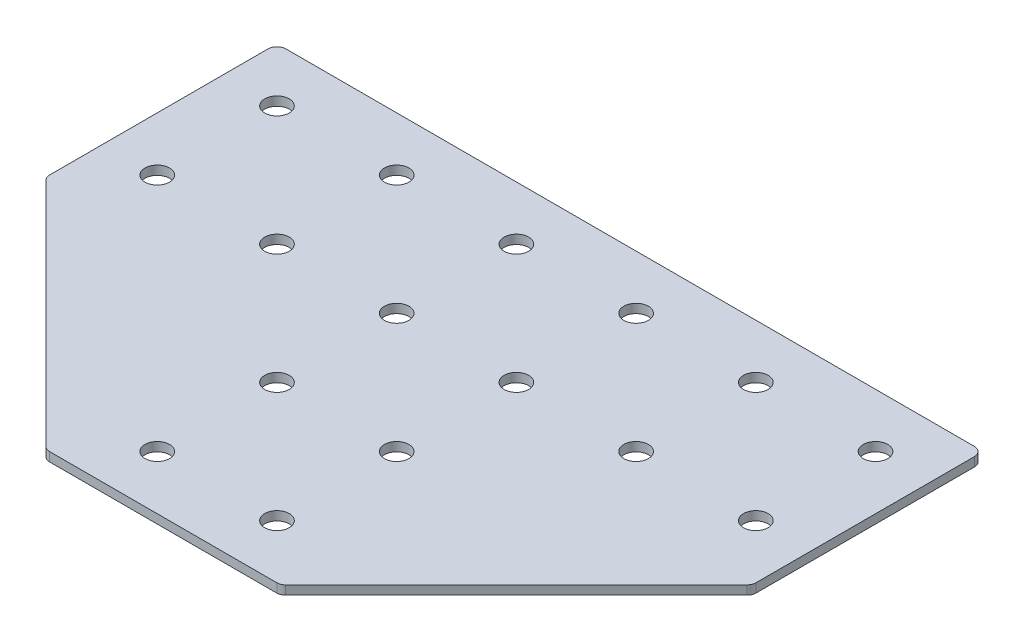
ISO-10303-21;
HEADER;
FILE_DESCRIPTION(('STEP AP214'),'2;1');
FILE_NAME('part.step','',(''),(''),'','','');
FILE_SCHEMA(('AUTOMOTIVE_DESIGN { 1 0 10303 214 1 1 1 1 }'));
ENDSEC;
DATA;
#1=APPLICATION_CONTEXT('core data for automotive mechanical design processes');
#2=APPLICATION_PROTOCOL_DEFINITION('international standard','automotive_design',2000,#1);
#3=PRODUCT_CONTEXT('',#1,'mechanical');
#4=PRODUCT('Part','Part','',(#3));
#5=PRODUCT_RELATED_PRODUCT_CATEGORY('part','',(#4));
#6=PRODUCT_DEFINITION_FORMATION('','',#4);
#7=PRODUCT_DEFINITION_CONTEXT('part definition',#1,'design');
#8=PRODUCT_DEFINITION('design','',#6,#7);
#9=PRODUCT_DEFINITION_SHAPE('','',#8);
#10=(LENGTH_UNIT() NAMED_UNIT(*) SI_UNIT(.MILLI.,.METRE.));
#11=(NAMED_UNIT(*) PLANE_ANGLE_UNIT() SI_UNIT($,.RADIAN.));
#12=(NAMED_UNIT(*) SI_UNIT($,.STERADIAN.) SOLID_ANGLE_UNIT());
#13=UNCERTAINTY_MEASURE_WITH_UNIT(LENGTH_MEASURE(1.E-05),#10,'distance_accuracy_value','');
#14=(GEOMETRIC_REPRESENTATION_CONTEXT(3) GLOBAL_UNCERTAINTY_ASSIGNED_CONTEXT((#13)) GLOBAL_UNIT_ASSIGNED_CONTEXT((#10,
#11,#12)) REPRESENTATION_CONTEXT('',''));
#15=CARTESIAN_POINT('',(0.,0.,0.));
#16=DIRECTION('',(0.,0.,1.));
#17=DIRECTION('',(1.,0.,0.));
#18=AXIS2_PLACEMENT_3D('',#15,#16,#17);
#19=CARTESIAN_POINT('',(-0.970001430630418,0.991348310229569,-41.520941998649));
#20=DIRECTION('',(0.,-1.,0.));
#21=DIRECTION('',(0.,0.,-1.));
#22=AXIS2_PLACEMENT_3D('',#19,#20,#21);
#23=PLANE('',#22);
#24=DIRECTION('',(1.,0.,0.));
#25=VECTOR('',#24,1.);
#26=CARTESIAN_POINT('',(-38.9700014306305,0.991348310229569,76.479058001351));
#27=LINE('',#26,#25);
#28=CARTESIAN_POINT('',(-38.898933618765,0.991348310229569,76.4790580013509));
#29=VERTEX_POINT('',#28);
#30=CARTESIAN_POINT('',(36.9589307575042,0.991348310229569,76.4790580013509));
#31=VERTEX_POINT('',#30);
#32=EDGE_CURVE('E218',#29,#31,#27,.T.);
#33=ORIENTED_EDGE('',*,*,#32,.F.);
#34=CARTESIAN_POINT('',(-38.898933618765,0.991348310229569,73.4790580013509));
#35=DIRECTION('',(0.,1.,0.));
#36=DIRECTION('',(0.,0.,-1.));
#37=AXIS2_PLACEMENT_3D('',#34,#35,#36);
#38=CIRCLE('',#37,3.);
#39=CARTESIAN_POINT('',(-41.0202539623247,0.991348310229569,75.6003783449106));
#40=VERTEX_POINT('',#39);
#41=EDGE_CURVE('E154',#40,#29,#38,.T.);
#42=ORIENTED_EDGE('',*,*,#41,.F.);
#43=DIRECTION('',(-0.707106781186547,0.,-0.707106781186548));
#44=VECTOR('',#43,1.);
#45=CARTESIAN_POINT('',(-40.1415743058843,0.991348310229569,76.479058001351));
#46=LINE('',#45,#44);
#47=CARTESIAN_POINT('',(-118.09132177419,0.991348310229569,-1.47068946695476));
#48=VERTEX_POINT('',#47);
#49=EDGE_CURVE('E141',#40,#48,#46,.T.);
#50=ORIENTED_EDGE('',*,*,#49,.T.);
#51=CARTESIAN_POINT('',(-115.97000143063,0.991348310229569,-3.59200981051438));
#52=DIRECTION('',(0.,1.,0.));
#53=DIRECTION('',(0.,0.,-1.));
#54=AXIS2_PLACEMENT_3D('',#51,#52,#53);
#55=CIRCLE('',#54,3.);
#56=CARTESIAN_POINT('',(-118.97000143063,0.991348310229569,-3.59200981051438));
#57=VERTEX_POINT('',#56);
#58=EDGE_CURVE('E152',#57,#48,#55,.T.);
#59=ORIENTED_EDGE('',*,*,#58,.F.);
#60=DIRECTION('',(0.,0.,-1.));
#61=VECTOR('',#60,1.);
#62=CARTESIAN_POINT('',(-118.97000143063,0.991348310229569,-2.3493691233951));
#63=LINE('',#62,#61);
#64=CARTESIAN_POINT('',(-118.97000143063,0.991348310229569,-76.520941998649));
#65=VERTEX_POINT('',#64);
#66=EDGE_CURVE('E124',#57,#65,#63,.T.);
#67=ORIENTED_EDGE('',*,*,#66,.T.);
#68=CARTESIAN_POINT('',(-115.97000143063,0.991348310229569,-76.520941998649));
#69=DIRECTION('',(0.,1.,0.));
#70=DIRECTION('',(0.,0.,-1.));
#71=AXIS2_PLACEMENT_3D('',#68,#69,#70);
#72=CIRCLE('',#71,3.);
#73=CARTESIAN_POINT('',(-115.97000143063,0.991348310229569,-79.520941998649));
#74=VERTEX_POINT('',#73);
#75=EDGE_CURVE('E149',#74,#65,#72,.T.);
#76=ORIENTED_EDGE('',*,*,#75,.F.);
#77=DIRECTION('',(-1.,0.,0.));
#78=VECTOR('',#77,1.);
#79=CARTESIAN_POINT('',(117.029998569369,0.991348310229569,-79.520941998649));
#80=LINE('',#79,#78);
#81=CARTESIAN_POINT('',(114.029998569369,0.991348310229569,-79.520941998649));
#82=VERTEX_POINT('',#81);
#83=EDGE_CURVE('E215',#82,#74,#80,.T.);
#84=ORIENTED_EDGE('',*,*,#83,.F.);
#85=CARTESIAN_POINT('',(114.029998569369,0.991348310229569,-76.520941998649));
#86=DIRECTION('',(0.,-1.,0.));
#87=DIRECTION('',(0.,0.,-1.));
#88=AXIS2_PLACEMENT_3D('',#85,#86,#87);
#89=CIRCLE('',#88,3.);
#90=CARTESIAN_POINT('',(117.029998569369,0.991348310229569,-76.520941998649));
#91=VERTEX_POINT('',#90);
#92=EDGE_CURVE('E239',#82,#91,#89,.T.);
#93=ORIENTED_EDGE('',*,*,#92,.T.);
#94=DIRECTION('',(0.,0.,-1.));
#95=VECTOR('',#94,1.);
#96=CARTESIAN_POINT('',(117.029998569369,0.991348310229569,-2.34936912339512));
#97=LINE('',#96,#95);
#98=CARTESIAN_POINT('',(117.029998569369,0.991348310229569,-3.5920098105144));
#99=VERTEX_POINT('',#98);
#100=EDGE_CURVE('E212',#99,#91,#97,.T.);
#101=ORIENTED_EDGE('',*,*,#100,.F.);
#102=CARTESIAN_POINT('',(114.029998569369,0.991348310229569,-3.5920098105144));
#103=DIRECTION('',(0.,-1.,0.));
#104=DIRECTION('',(0.,0.,-1.));
#105=AXIS2_PLACEMENT_3D('',#102,#103,#104);
#106=CIRCLE('',#105,3.);
#107=CARTESIAN_POINT('',(116.151318912929,0.991348310229569,-1.47068946695478));
#108=VERTEX_POINT('',#107);
#109=EDGE_CURVE('E31',#99,#108,#106,.T.);
#110=ORIENTED_EDGE('',*,*,#109,.T.);
#111=DIRECTION('',(0.707106781186547,0.,-0.707106781186548));
#112=VECTOR('',#111,1.);
#113=CARTESIAN_POINT('',(38.2015714446235,0.991348310229569,76.4790580013509));
#114=LINE('',#113,#112);
#115=CARTESIAN_POINT('',(39.0802511010639,0.991348310229569,75.6003783449106));
#116=VERTEX_POINT('',#115);
#117=EDGE_CURVE('E220',#116,#108,#114,.T.);
#118=ORIENTED_EDGE('',*,*,#117,.F.);
#119=CARTESIAN_POINT('',(36.9589307575042,0.991348310229569,73.4790580013509));
#120=DIRECTION('',(0.,-1.,0.));
#121=DIRECTION('',(0.,0.,-1.));
#122=AXIS2_PLACEMENT_3D('',#119,#120,#121);
#123=CIRCLE('',#122,3.);
#124=EDGE_CURVE('E242',#116,#31,#123,.T.);
#125=ORIENTED_EDGE('',*,*,#124,.T.);
#126=EDGE_LOOP('',(#33,#42,#50,#59,#67,#76,#84,#93,#101,#110,#118,#125));
#127=FACE_BOUND('',#126,.T.);
#128=CARTESIAN_POINT('',(99.0299985693696,0.991348310229569,-21.520941998649));
#129=DIRECTION('',(0.,1.,0.));
#130=DIRECTION('',(0.,0.,1.));
#131=AXIS2_PLACEMENT_3D('',#128,#129,#130);
#132=CIRCLE('',#131,4.1);
#133=CARTESIAN_POINT('',(99.0299985693696,0.991348310229569,-17.420941998649));
#134=VERTEX_POINT('',#133);
#135=EDGE_CURVE('E164',#134,#134,#132,.T.);
#136=ORIENTED_EDGE('',*,*,#135,.T.);
#137=EDGE_LOOP('',(#136));
#138=FACE_BOUND('',#137,.T.);
#139=CARTESIAN_POINT('',(59.0299985693696,0.991348310229569,-21.520941998649));
#140=DIRECTION('',(0.,1.,0.));
#141=DIRECTION('',(0.,0.,1.));
#142=AXIS2_PLACEMENT_3D('',#139,#140,#141);
#143=CIRCLE('',#142,4.1);
#144=CARTESIAN_POINT('',(59.0299985693696,0.991348310229569,-17.420941998649));
#145=VERTEX_POINT('',#144);
#146=EDGE_CURVE('E170',#145,#145,#143,.T.);
#147=ORIENTED_EDGE('',*,*,#146,.T.);
#148=EDGE_LOOP('',(#147));
#149=FACE_BOUND('',#148,.T.);
#150=CARTESIAN_POINT('',(19.0299985693696,0.991348310229569,58.479058001351));
#151=DIRECTION('',(0.,1.,0.));
#152=DIRECTION('',(0.,0.,1.));
#153=AXIS2_PLACEMENT_3D('',#150,#151,#152);
#154=CIRCLE('',#153,4.1);
#155=CARTESIAN_POINT('',(19.0299985693696,0.991348310229569,62.579058001351));
#156=VERTEX_POINT('',#155);
#157=EDGE_CURVE('E176',#156,#156,#154,.T.);
#158=ORIENTED_EDGE('',*,*,#157,.T.);
#159=EDGE_LOOP('',(#158));
#160=FACE_BOUND('',#159,.T.);
#161=CARTESIAN_POINT('',(19.0299985693696,0.991348310229569,18.479058001351));
#162=DIRECTION('',(0.,1.,0.));
#163=DIRECTION('',(0.,0.,1.));
#164=AXIS2_PLACEMENT_3D('',#161,#162,#163);
#165=CIRCLE('',#164,4.1);
#166=CARTESIAN_POINT('',(19.0299985693696,0.991348310229569,22.579058001351));
#167=VERTEX_POINT('',#166);
#168=EDGE_CURVE('E182',#167,#167,#165,.T.);
#169=ORIENTED_EDGE('',*,*,#168,.T.);
#170=EDGE_LOOP('',(#169));
#171=FACE_BOUND('',#170,.T.);
#172=CARTESIAN_POINT('',(19.0299985693696,0.991348310229569,-21.520941998649));
#173=DIRECTION('',(0.,1.,0.));
#174=DIRECTION('',(0.,0.,1.));
#175=AXIS2_PLACEMENT_3D('',#172,#173,#174);
#176=CIRCLE('',#175,4.1);
#177=CARTESIAN_POINT('',(19.0299985693696,0.991348310229569,-17.420941998649));
#178=VERTEX_POINT('',#177);
#179=EDGE_CURVE('E188',#178,#178,#176,.T.);
#180=ORIENTED_EDGE('',*,*,#179,.T.);
#181=EDGE_LOOP('',(#180));
#182=FACE_BOUND('',#181,.T.);
#183=CARTESIAN_POINT('',(99.0299985693696,0.991348310229569,-61.520941998649));
#184=DIRECTION('',(0.,1.,0.));
#185=DIRECTION('',(0.,0.,1.));
#186=AXIS2_PLACEMENT_3D('',#183,#184,#185);
#187=CIRCLE('',#186,4.1);
#188=CARTESIAN_POINT('',(99.0299985693696,0.991348310229569,-57.420941998649));
#189=VERTEX_POINT('',#188);
#190=EDGE_CURVE('E194',#189,#189,#187,.T.);
#191=ORIENTED_EDGE('',*,*,#190,.T.);
#192=EDGE_LOOP('',(#191));
#193=FACE_BOUND('',#192,.T.);
#194=CARTESIAN_POINT('',(59.0299985693696,0.991348310229569,-61.520941998649));
#195=DIRECTION('',(0.,1.,0.));
#196=DIRECTION('',(0.,0.,1.));
#197=AXIS2_PLACEMENT_3D('',#194,#195,#196);
#198=CIRCLE('',#197,4.1);
#199=CARTESIAN_POINT('',(59.0299985693696,0.991348310229569,-57.420941998649));
#200=VERTEX_POINT('',#199);
#201=EDGE_CURVE('E200',#200,#200,#198,.T.);
#202=ORIENTED_EDGE('',*,*,#201,.T.);
#203=EDGE_LOOP('',(#202));
#204=FACE_BOUND('',#203,.T.);
#205=CARTESIAN_POINT('',(19.0299985693696,0.991348310229569,-61.520941998649));
#206=DIRECTION('',(0.,1.,0.));
#207=DIRECTION('',(0.,0.,1.));
#208=AXIS2_PLACEMENT_3D('',#205,#206,#207);
#209=CIRCLE('',#208,4.1);
#210=CARTESIAN_POINT('',(19.0299985693696,0.991348310229569,-57.420941998649));
#211=VERTEX_POINT('',#210);
#212=EDGE_CURVE('E206',#211,#211,#209,.T.);
#213=ORIENTED_EDGE('',*,*,#212,.T.);
#214=EDGE_LOOP('',(#213));
#215=FACE_BOUND('',#214,.T.);
#216=CARTESIAN_POINT('',(-100.97000143063,0.991348310229569,-21.520941998649));
#217=DIRECTION('',(0.,-1.,0.));
#218=DIRECTION('',(0.,0.,1.));
#219=AXIS2_PLACEMENT_3D('',#216,#217,#218);
#220=CIRCLE('',#219,4.1);
#221=CARTESIAN_POINT('',(-100.97000143063,0.991348310229569,-17.420941998649));
#222=VERTEX_POINT('',#221);
#223=EDGE_CURVE('E318',#222,#222,#220,.T.);
#224=ORIENTED_EDGE('',*,*,#223,.F.);
#225=EDGE_LOOP('',(#224));
#226=FACE_BOUND('',#225,.T.);
#227=CARTESIAN_POINT('',(-60.9700014306304,0.991348310229569,-21.520941998649));
#228=DIRECTION('',(0.,-1.,0.));
#229=DIRECTION('',(0.,0.,1.));
#230=AXIS2_PLACEMENT_3D('',#227,#228,#229);
#231=CIRCLE('',#230,4.1);
#232=CARTESIAN_POINT('',(-60.9700014306304,0.991348310229569,-17.420941998649));
#233=VERTEX_POINT('',#232);
#234=EDGE_CURVE('E312',#233,#233,#231,.T.);
#235=ORIENTED_EDGE('',*,*,#234,.F.);
#236=EDGE_LOOP('',(#235));
#237=FACE_BOUND('',#236,.T.);
#238=CARTESIAN_POINT('',(-20.9700014306304,0.991348310229569,58.479058001351));
#239=DIRECTION('',(0.,-1.,0.));
#240=DIRECTION('',(0.,0.,1.));
#241=AXIS2_PLACEMENT_3D('',#238,#239,#240);
#242=CIRCLE('',#241,4.1);
#243=CARTESIAN_POINT('',(-20.9700014306304,0.991348310229569,62.579058001351));
#244=VERTEX_POINT('',#243);
#245=EDGE_CURVE('E306',#244,#244,#242,.T.);
#246=ORIENTED_EDGE('',*,*,#245,.F.);
#247=EDGE_LOOP('',(#246));
#248=FACE_BOUND('',#247,.T.);
#249=CARTESIAN_POINT('',(-20.9700014306304,0.991348310229569,18.479058001351));
#250=DIRECTION('',(0.,-1.,0.));
#251=DIRECTION('',(0.,0.,1.));
#252=AXIS2_PLACEMENT_3D('',#249,#250,#251);
#253=CIRCLE('',#252,4.1);
#254=CARTESIAN_POINT('',(-20.9700014306304,0.991348310229569,22.579058001351));
#255=VERTEX_POINT('',#254);
#256=EDGE_CURVE('E300',#255,#255,#253,.T.);
#257=ORIENTED_EDGE('',*,*,#256,.F.);
#258=EDGE_LOOP('',(#257));
#259=FACE_BOUND('',#258,.T.);
#260=CARTESIAN_POINT('',(-20.9700014306304,0.991348310229569,-21.520941998649));
#261=DIRECTION('',(0.,-1.,0.));
#262=DIRECTION('',(0.,0.,1.));
#263=AXIS2_PLACEMENT_3D('',#260,#261,#262);
#264=CIRCLE('',#263,4.1);
#265=CARTESIAN_POINT('',(-20.9700014306304,0.991348310229569,-17.420941998649));
#266=VERTEX_POINT('',#265);
#267=EDGE_CURVE('E294',#266,#266,#264,.T.);
#268=ORIENTED_EDGE('',*,*,#267,.F.);
#269=EDGE_LOOP('',(#268));
#270=FACE_BOUND('',#269,.T.);
#271=CARTESIAN_POINT('',(-100.97000143063,0.991348310229569,-61.520941998649));
#272=DIRECTION('',(0.,-1.,0.));
#273=DIRECTION('',(0.,0.,1.));
#274=AXIS2_PLACEMENT_3D('',#271,#272,#273);
#275=CIRCLE('',#274,4.1);
#276=CARTESIAN_POINT('',(-100.97000143063,0.991348310229569,-57.420941998649));
#277=VERTEX_POINT('',#276);
#278=EDGE_CURVE('E288',#277,#277,#275,.T.);
#279=ORIENTED_EDGE('',*,*,#278,.F.);
#280=EDGE_LOOP('',(#279));
#281=FACE_BOUND('',#280,.T.);
#282=CARTESIAN_POINT('',(-60.9700014306304,0.991348310229569,-61.520941998649));
#283=DIRECTION('',(0.,-1.,0.));
#284=DIRECTION('',(0.,0.,1.));
#285=AXIS2_PLACEMENT_3D('',#282,#283,#284);
#286=CIRCLE('',#285,4.1);
#287=CARTESIAN_POINT('',(-60.9700014306304,0.991348310229569,-57.420941998649));
#288=VERTEX_POINT('',#287);
#289=EDGE_CURVE('E283',#288,#288,#286,.T.);
#290=ORIENTED_EDGE('',*,*,#289,.F.);
#291=EDGE_LOOP('',(#290));
#292=FACE_BOUND('',#291,.T.);
#293=CARTESIAN_POINT('',(-20.9700014306304,0.991348310229569,-61.520941998649));
#294=DIRECTION('',(0.,-1.,0.));
#295=DIRECTION('',(0.,0.,1.));
#296=AXIS2_PLACEMENT_3D('',#293,#294,#295);
#297=CIRCLE('',#296,4.1);
#298=CARTESIAN_POINT('',(-20.9700014306304,0.991348310229569,-57.420941998649));
#299=VERTEX_POINT('',#298);
#300=EDGE_CURVE('E134',#299,#299,#297,.T.);
#301=ORIENTED_EDGE('',*,*,#300,.F.);
#302=EDGE_LOOP('',(#301));
#303=FACE_BOUND('',#302,.T.);
#304=ADVANCED_FACE('F16',(#127,#138,#149,#160,#171,#182,#193,#204,#215,#226,#237,#248,#259,#270,
#281,#292,#303),#23,.T.);
#305=CARTESIAN_POINT('',(117.029998569369,0.991348310229569,-2.34936912339512));
#306=DIRECTION('',(1.,0.,0.));
#307=DIRECTION('',(0.,0.,-1.));
#308=AXIS2_PLACEMENT_3D('',#305,#306,#307);
#309=PLANE('',#308);
#310=DIRECTION('',(0.,0.,-1.));
#311=VECTOR('',#310,1.);
#312=CARTESIAN_POINT('',(117.029998569369,3.99134831022957,-2.34936912339512));
#313=LINE('',#312,#311);
#314=CARTESIAN_POINT('',(117.029998569369,3.99134831022957,-3.5920098105144));
#315=VERTEX_POINT('',#314);
#316=CARTESIAN_POINT('',(117.029998569369,3.99134831022957,-76.520941998649));
#317=VERTEX_POINT('',#316);
#318=EDGE_CURVE('E209',#315,#317,#313,.T.);
#319=ORIENTED_EDGE('',*,*,#318,.F.);
#320=DIRECTION('',(0.,1.,0.));
#321=VECTOR('',#320,1.);
#322=CARTESIAN_POINT('',(117.029998569369,0.991348310229569,-3.5920098105144));
#323=LINE('',#322,#321);
#324=EDGE_CURVE('E24',#315,#99,#323,.F.);
#325=ORIENTED_EDGE('',*,*,#324,.T.);
#326=ORIENTED_EDGE('',*,*,#100,.T.);
#327=DIRECTION('',(0.,1.,0.));
#328=VECTOR('',#327,1.);
#329=CARTESIAN_POINT('',(117.029998569369,0.991348310229569,-76.520941998649));
#330=LINE('',#329,#328);
#331=EDGE_CURVE('E249',#91,#317,#330,.T.);
#332=ORIENTED_EDGE('',*,*,#331,.T.);
#333=EDGE_LOOP('',(#319,#325,#326,#332));
#334=FACE_BOUND('',#333,.T.);
#335=ADVANCED_FACE('F254',(#334),#309,.T.);
#336=CARTESIAN_POINT('',(38.2015714446235,0.991348310229569,76.4790580013509));
#337=DIRECTION('',(0.707106781186548,0.,0.707106781186547));
#338=DIRECTION('',(0.707106781186547,0.,-0.707106781186548));
#339=AXIS2_PLACEMENT_3D('',#336,#337,#338);
#340=PLANE('',#339);
#341=DIRECTION('',(0.707106781186547,0.,-0.707106781186548));
#342=VECTOR('',#341,1.);
#343=CARTESIAN_POINT('',(38.2015714446235,3.99134831022957,76.4790580013509));
#344=LINE('',#343,#342);
#345=CARTESIAN_POINT('',(39.0802511010639,3.99134831022957,75.6003783449106));
#346=VERTEX_POINT('',#345);
#347=CARTESIAN_POINT('',(116.151318912929,3.99134831022957,-1.47068946695478));
#348=VERTEX_POINT('',#347);
#349=EDGE_CURVE('E216',#346,#348,#344,.T.);
#350=ORIENTED_EDGE('',*,*,#349,.F.);
#351=DIRECTION('',(0.,1.,0.));
#352=VECTOR('',#351,1.);
#353=CARTESIAN_POINT('',(39.0802511010639,0.991348310229569,75.6003783449106));
#354=LINE('',#353,#352);
#355=EDGE_CURVE('E38',#346,#116,#354,.F.);
#356=ORIENTED_EDGE('',*,*,#355,.T.);
#357=ORIENTED_EDGE('',*,*,#117,.T.);
#358=DIRECTION('',(0.,1.,0.));
#359=VECTOR('',#358,1.);
#360=CARTESIAN_POINT('',(116.151318912929,0.991348310229569,-1.47068946695478));
#361=LINE('',#360,#359);
#362=EDGE_CURVE('E245',#108,#348,#361,.T.);
#363=ORIENTED_EDGE('',*,*,#362,.T.);
#364=EDGE_LOOP('',(#350,#356,#357,#363));
#365=FACE_BOUND('',#364,.T.);
#366=ADVANCED_FACE('F262',(#365),#340,.T.);
#367=CARTESIAN_POINT('',(-38.9700014306305,0.991348310229569,76.479058001351));
#368=DIRECTION('',(0.,0.,1.));
#369=DIRECTION('',(1.,0.,0.));
#370=AXIS2_PLACEMENT_3D('',#367,#368,#369);
#371=PLANE('',#370);
#372=DIRECTION('',(1.,0.,0.));
#373=VECTOR('',#372,1.);
#374=CARTESIAN_POINT('',(-38.9700014306305,3.99134831022957,76.479058001351));
#375=LINE('',#374,#373);
#376=CARTESIAN_POINT('',(-38.898933618765,3.99134831022957,76.4790580013509));
#377=VERTEX_POINT('',#376);
#378=CARTESIAN_POINT('',(36.9589307575042,3.99134831022957,76.4790580013509));
#379=VERTEX_POINT('',#378);
#380=EDGE_CURVE('E227',#377,#379,#375,.T.);
#381=ORIENTED_EDGE('',*,*,#380,.F.);
#382=DIRECTION('',(0.,1.,0.));
#383=VECTOR('',#382,1.);
#384=CARTESIAN_POINT('',(-38.898933618765,0.991348310229569,76.4790580013509));
#385=LINE('',#384,#383);
#386=EDGE_CURVE('E146',#29,#377,#385,.T.);
#387=ORIENTED_EDGE('',*,*,#386,.F.);
#388=ORIENTED_EDGE('',*,*,#32,.T.);
#389=DIRECTION('',(0.,1.,0.));
#390=VECTOR('',#389,1.);
#391=CARTESIAN_POINT('',(36.9589307575042,0.991348310229569,76.4790580013509));
#392=LINE('',#391,#390);
#393=EDGE_CURVE('E236',#31,#379,#392,.T.);
#394=ORIENTED_EDGE('',*,*,#393,.T.);
#395=EDGE_LOOP('',(#381,#387,#388,#394));
#396=FACE_BOUND('',#395,.T.);
#397=ADVANCED_FACE('F270',(#396),#371,.T.);
#398=CARTESIAN_POINT('',(117.029998569369,0.991348310229569,-79.520941998649));
#399=DIRECTION('',(0.,0.,-1.));
#400=DIRECTION('',(-1.,0.,0.));
#401=AXIS2_PLACEMENT_3D('',#398,#399,#400);
#402=PLANE('',#401);
#403=ORIENTED_EDGE('',*,*,#83,.T.);
#404=DIRECTION('',(0.,1.,0.));
#405=VECTOR('',#404,1.);
#406=CARTESIAN_POINT('',(-115.97000143063,0.991348310229569,-79.520941998649));
#407=LINE('',#406,#405);
#408=CARTESIAN_POINT('',(-115.97000143063,3.99134831022957,-79.520941998649));
#409=VERTEX_POINT('',#408);
#410=EDGE_CURVE('E126',#409,#74,#407,.F.);
#411=ORIENTED_EDGE('',*,*,#410,.F.);
#412=DIRECTION('',(-1.,0.,0.));
#413=VECTOR('',#412,1.);
#414=CARTESIAN_POINT('',(117.029998569369,3.99134831022957,-79.520941998649));
#415=LINE('',#414,#413);
#416=CARTESIAN_POINT('',(114.029998569369,3.99134831022957,-79.520941998649));
#417=VERTEX_POINT('',#416);
#418=EDGE_CURVE('E225',#417,#409,#415,.T.);
#419=ORIENTED_EDGE('',*,*,#418,.F.);
#420=DIRECTION('',(0.,1.,0.));
#421=VECTOR('',#420,1.);
#422=CARTESIAN_POINT('',(114.029998569369,0.991348310229569,-79.520941998649));
#423=LINE('',#422,#421);
#424=EDGE_CURVE('E10',#417,#82,#423,.F.);
#425=ORIENTED_EDGE('',*,*,#424,.T.);
#426=EDGE_LOOP('',(#403,#411,#419,#425));
#427=FACE_BOUND('',#426,.T.);
#428=ADVANCED_FACE('F356',(#427),#402,.T.);
#429=CARTESIAN_POINT('',(-0.970001430630418,3.99134831022957,-41.520941998649));
#430=DIRECTION('',(0.,-1.,0.));
#431=DIRECTION('',(0.,0.,-1.));
#432=AXIS2_PLACEMENT_3D('',#429,#430,#431);
#433=PLANE('',#432);
#434=CARTESIAN_POINT('',(99.0299985693696,3.99134831022957,-21.520941998649));
#435=DIRECTION('',(0.,1.,0.));
#436=DIRECTION('',(0.,0.,1.));
#437=AXIS2_PLACEMENT_3D('',#434,#435,#436);
#438=CIRCLE('',#437,4.1);
#439=CARTESIAN_POINT('',(99.0299985693696,3.99134831022957,-17.420941998649));
#440=VERTEX_POINT('',#439);
#441=EDGE_CURVE('E163',#440,#440,#438,.T.);
#442=ORIENTED_EDGE('',*,*,#441,.F.);
#443=EDGE_LOOP('',(#442));
#444=FACE_BOUND('',#443,.T.);
#445=CARTESIAN_POINT('',(59.0299985693696,3.99134831022957,-21.520941998649));
#446=DIRECTION('',(0.,1.,0.));
#447=DIRECTION('',(0.,0.,1.));
#448=AXIS2_PLACEMENT_3D('',#445,#446,#447);
#449=CIRCLE('',#448,4.1);
#450=CARTESIAN_POINT('',(59.0299985693696,3.99134831022957,-17.420941998649));
#451=VERTEX_POINT('',#450);
#452=EDGE_CURVE('E167',#451,#451,#449,.T.);
#453=ORIENTED_EDGE('',*,*,#452,.F.);
#454=EDGE_LOOP('',(#453));
#455=FACE_BOUND('',#454,.T.);
#456=CARTESIAN_POINT('',(19.0299985693696,3.99134831022957,58.479058001351));
#457=DIRECTION('',(0.,1.,0.));
#458=DIRECTION('',(0.,0.,1.));
#459=AXIS2_PLACEMENT_3D('',#456,#457,#458);
#460=CIRCLE('',#459,4.1);
#461=CARTESIAN_POINT('',(19.0299985693696,3.99134831022957,62.579058001351));
#462=VERTEX_POINT('',#461);
#463=EDGE_CURVE('E173',#462,#462,#460,.T.);
#464=ORIENTED_EDGE('',*,*,#463,.F.);
#465=EDGE_LOOP('',(#464));
#466=FACE_BOUND('',#465,.T.);
#467=CARTESIAN_POINT('',(19.0299985693696,3.99134831022957,18.479058001351));
#468=DIRECTION('',(0.,1.,0.));
#469=DIRECTION('',(0.,0.,1.));
#470=AXIS2_PLACEMENT_3D('',#467,#468,#469);
#471=CIRCLE('',#470,4.1);
#472=CARTESIAN_POINT('',(19.0299985693696,3.99134831022957,22.579058001351));
#473=VERTEX_POINT('',#472);
#474=EDGE_CURVE('E179',#473,#473,#471,.T.);
#475=ORIENTED_EDGE('',*,*,#474,.F.);
#476=EDGE_LOOP('',(#475));
#477=FACE_BOUND('',#476,.T.);
#478=CARTESIAN_POINT('',(19.0299985693696,3.99134831022957,-21.520941998649));
#479=DIRECTION('',(0.,1.,0.));
#480=DIRECTION('',(0.,0.,1.));
#481=AXIS2_PLACEMENT_3D('',#478,#479,#480);
#482=CIRCLE('',#481,4.1);
#483=CARTESIAN_POINT('',(19.0299985693696,3.99134831022957,-17.420941998649));
#484=VERTEX_POINT('',#483);
#485=EDGE_CURVE('E185',#484,#484,#482,.T.);
#486=ORIENTED_EDGE('',*,*,#485,.F.);
#487=EDGE_LOOP('',(#486));
#488=FACE_BOUND('',#487,.T.);
#489=CARTESIAN_POINT('',(99.0299985693696,3.99134831022957,-61.520941998649));
#490=DIRECTION('',(0.,1.,0.));
#491=DIRECTION('',(0.,0.,1.));
#492=AXIS2_PLACEMENT_3D('',#489,#490,#491);
#493=CIRCLE('',#492,4.1);
#494=CARTESIAN_POINT('',(99.0299985693696,3.99134831022957,-57.420941998649));
#495=VERTEX_POINT('',#494);
#496=EDGE_CURVE('E191',#495,#495,#493,.T.);
#497=ORIENTED_EDGE('',*,*,#496,.F.);
#498=EDGE_LOOP('',(#497));
#499=FACE_BOUND('',#498,.T.);
#500=CARTESIAN_POINT('',(59.0299985693696,3.99134831022957,-61.520941998649));
#501=DIRECTION('',(0.,1.,0.));
#502=DIRECTION('',(0.,0.,1.));
#503=AXIS2_PLACEMENT_3D('',#500,#501,#502);
#504=CIRCLE('',#503,4.1);
#505=CARTESIAN_POINT('',(59.0299985693696,3.99134831022957,-57.420941998649));
#506=VERTEX_POINT('',#505);
#507=EDGE_CURVE('E197',#506,#506,#504,.T.);
#508=ORIENTED_EDGE('',*,*,#507,.F.);
#509=EDGE_LOOP('',(#508));
#510=FACE_BOUND('',#509,.T.);
#511=CARTESIAN_POINT('',(19.0299985693696,3.99134831022957,-61.520941998649));
#512=DIRECTION('',(0.,1.,0.));
#513=DIRECTION('',(0.,0.,1.));
#514=AXIS2_PLACEMENT_3D('',#511,#512,#513);
#515=CIRCLE('',#514,4.1);
#516=CARTESIAN_POINT('',(19.0299985693696,3.99134831022957,-57.420941998649));
#517=VERTEX_POINT('',#516);
#518=EDGE_CURVE('E203',#517,#517,#515,.T.);
#519=ORIENTED_EDGE('',*,*,#518,.F.);
#520=EDGE_LOOP('',(#519));
#521=FACE_BOUND('',#520,.T.);
#522=ORIENTED_EDGE('',*,*,#418,.T.);
#523=CARTESIAN_POINT('',(-115.97000143063,3.99134831022957,-76.520941998649));
#524=DIRECTION('',(0.,1.,0.));
#525=DIRECTION('',(0.,0.,-1.));
#526=AXIS2_PLACEMENT_3D('',#523,#524,#525);
#527=CIRCLE('',#526,3.);
#528=CARTESIAN_POINT('',(-118.97000143063,3.99134831022957,-76.520941998649));
#529=VERTEX_POINT('',#528);
#530=EDGE_CURVE('E117',#529,#409,#527,.F.);
#531=ORIENTED_EDGE('',*,*,#530,.F.);
#532=DIRECTION('',(0.,0.,-1.));
#533=VECTOR('',#532,1.);
#534=CARTESIAN_POINT('',(-118.97000143063,3.99134831022957,-2.3493691233951));
#535=LINE('',#534,#533);
#536=CARTESIAN_POINT('',(-118.97000143063,3.99134831022957,-3.59200981051438));
#537=VERTEX_POINT('',#536);
#538=EDGE_CURVE('E122',#537,#529,#535,.T.);
#539=ORIENTED_EDGE('',*,*,#538,.F.);
#540=CARTESIAN_POINT('',(-115.97000143063,3.99134831022957,-3.59200981051438));
#541=DIRECTION('',(0.,1.,0.));
#542=DIRECTION('',(0.,0.,-1.));
#543=AXIS2_PLACEMENT_3D('',#540,#541,#542);
#544=CIRCLE('',#543,3.);
#545=CARTESIAN_POINT('',(-118.09132177419,3.99134831022957,-1.47068946695476));
#546=VERTEX_POINT('',#545);
#547=EDGE_CURVE('E105',#546,#537,#544,.F.);
#548=ORIENTED_EDGE('',*,*,#547,.F.);
#549=DIRECTION('',(-0.707106781186547,0.,-0.707106781186548));
#550=VECTOR('',#549,1.);
#551=CARTESIAN_POINT('',(-40.1415743058843,3.99134831022957,76.479058001351));
#552=LINE('',#551,#550);
#553=CARTESIAN_POINT('',(-41.0202539623247,3.99134831022957,75.6003783449106));
#554=VERTEX_POINT('',#553);
#555=EDGE_CURVE('E133',#554,#546,#552,.T.);
#556=ORIENTED_EDGE('',*,*,#555,.F.);
#557=CARTESIAN_POINT('',(-38.898933618765,3.99134831022957,73.4790580013509));
#558=DIRECTION('',(0.,1.,0.));
#559=DIRECTION('',(0.,0.,-1.));
#560=AXIS2_PLACEMENT_3D('',#557,#558,#559);
#561=CIRCLE('',#560,3.);
#562=EDGE_CURVE('E116',#377,#554,#561,.F.);
#563=ORIENTED_EDGE('',*,*,#562,.F.);
#564=ORIENTED_EDGE('',*,*,#380,.T.);
#565=CARTESIAN_POINT('',(36.9589307575042,3.99134831022957,73.4790580013509));
#566=DIRECTION('',(0.,-1.,0.));
#567=DIRECTION('',(0.,0.,-1.));
#568=AXIS2_PLACEMENT_3D('',#565,#566,#567);
#569=CIRCLE('',#568,3.);
#570=EDGE_CURVE('E234',#379,#346,#569,.F.);
#571=ORIENTED_EDGE('',*,*,#570,.T.);
#572=ORIENTED_EDGE('',*,*,#349,.T.);
#573=CARTESIAN_POINT('',(114.029998569369,3.99134831022957,-3.5920098105144));
#574=DIRECTION('',(0.,-1.,0.));
#575=DIRECTION('',(0.,0.,-1.));
#576=AXIS2_PLACEMENT_3D('',#573,#574,#575);
#577=CIRCLE('',#576,3.);
#578=EDGE_CURVE('E232',#348,#315,#577,.F.);
#579=ORIENTED_EDGE('',*,*,#578,.T.);
#580=ORIENTED_EDGE('',*,*,#318,.T.);
#581=CARTESIAN_POINT('',(114.029998569369,3.99134831022957,-76.520941998649));
#582=DIRECTION('',(0.,-1.,0.));
#583=DIRECTION('',(0.,0.,-1.));
#584=AXIS2_PLACEMENT_3D('',#581,#582,#583);
#585=CIRCLE('',#584,3.);
#586=EDGE_CURVE('E222',#317,#417,#585,.F.);
#587=ORIENTED_EDGE('',*,*,#586,.T.);
#588=EDGE_LOOP('',(#522,#531,#539,#548,#556,#563,#564,#571,#572,#579,#580,#587));
#589=FACE_BOUND('',#588,.T.);
#590=CARTESIAN_POINT('',(-100.97000143063,3.99134831022957,-21.520941998649));
#591=DIRECTION('',(0.,-1.,0.));
#592=DIRECTION('',(0.,0.,1.));
#593=AXIS2_PLACEMENT_3D('',#590,#591,#592);
#594=CIRCLE('',#593,4.1);
#595=CARTESIAN_POINT('',(-100.97000143063,3.99134831022957,-17.420941998649));
#596=VERTEX_POINT('',#595);
#597=EDGE_CURVE('E321',#596,#596,#594,.T.);
#598=ORIENTED_EDGE('',*,*,#597,.T.);
#599=EDGE_LOOP('',(#598));
#600=FACE_BOUND('',#599,.T.);
#601=CARTESIAN_POINT('',(-60.9700014306304,3.99134831022957,-21.520941998649));
#602=DIRECTION('',(0.,-1.,0.));
#603=DIRECTION('',(0.,0.,1.));
#604=AXIS2_PLACEMENT_3D('',#601,#602,#603);
#605=CIRCLE('',#604,4.1);
#606=CARTESIAN_POINT('',(-60.9700014306304,3.99134831022957,-17.420941998649));
#607=VERTEX_POINT('',#606);
#608=EDGE_CURVE('E315',#607,#607,#605,.T.);
#609=ORIENTED_EDGE('',*,*,#608,.T.);
#610=EDGE_LOOP('',(#609));
#611=FACE_BOUND('',#610,.T.);
#612=CARTESIAN_POINT('',(-20.9700014306304,3.99134831022957,58.479058001351));
#613=DIRECTION('',(0.,-1.,0.));
#614=DIRECTION('',(0.,0.,1.));
#615=AXIS2_PLACEMENT_3D('',#612,#613,#614);
#616=CIRCLE('',#615,4.1);
#617=CARTESIAN_POINT('',(-20.9700014306304,3.99134831022957,62.579058001351));
#618=VERTEX_POINT('',#617);
#619=EDGE_CURVE('E309',#618,#618,#616,.T.);
#620=ORIENTED_EDGE('',*,*,#619,.T.);
#621=EDGE_LOOP('',(#620));
#622=FACE_BOUND('',#621,.T.);
#623=CARTESIAN_POINT('',(-20.9700014306304,3.99134831022957,18.479058001351));
#624=DIRECTION('',(0.,-1.,0.));
#625=DIRECTION('',(0.,0.,1.));
#626=AXIS2_PLACEMENT_3D('',#623,#624,#625);
#627=CIRCLE('',#626,4.1);
#628=CARTESIAN_POINT('',(-20.9700014306304,3.99134831022957,22.579058001351));
#629=VERTEX_POINT('',#628);
#630=EDGE_CURVE('E303',#629,#629,#627,.T.);
#631=ORIENTED_EDGE('',*,*,#630,.T.);
#632=EDGE_LOOP('',(#631));
#633=FACE_BOUND('',#632,.T.);
#634=CARTESIAN_POINT('',(-20.9700014306304,3.99134831022957,-21.520941998649));
#635=DIRECTION('',(0.,-1.,0.));
#636=DIRECTION('',(0.,0.,1.));
#637=AXIS2_PLACEMENT_3D('',#634,#635,#636);
#638=CIRCLE('',#637,4.1);
#639=CARTESIAN_POINT('',(-20.9700014306304,3.99134831022957,-17.420941998649));
#640=VERTEX_POINT('',#639);
#641=EDGE_CURVE('E297',#640,#640,#638,.T.);
#642=ORIENTED_EDGE('',*,*,#641,.T.);
#643=EDGE_LOOP('',(#642));
#644=FACE_BOUND('',#643,.T.);
#645=CARTESIAN_POINT('',(-100.97000143063,3.99134831022957,-61.520941998649));
#646=DIRECTION('',(0.,-1.,0.));
#647=DIRECTION('',(0.,0.,1.));
#648=AXIS2_PLACEMENT_3D('',#645,#646,#647);
#649=CIRCLE('',#648,4.1);
#650=CARTESIAN_POINT('',(-100.97000143063,3.99134831022957,-57.420941998649));
#651=VERTEX_POINT('',#650);
#652=EDGE_CURVE('E291',#651,#651,#649,.T.);
#653=ORIENTED_EDGE('',*,*,#652,.T.);
#654=EDGE_LOOP('',(#653));
#655=FACE_BOUND('',#654,.T.);
#656=CARTESIAN_POINT('',(-60.9700014306304,3.99134831022957,-61.520941998649));
#657=DIRECTION('',(0.,-1.,0.));
#658=DIRECTION('',(0.,0.,1.));
#659=AXIS2_PLACEMENT_3D('',#656,#657,#658);
#660=CIRCLE('',#659,4.1);
#661=CARTESIAN_POINT('',(-60.9700014306304,3.99134831022957,-57.420941998649));
#662=VERTEX_POINT('',#661);
#663=EDGE_CURVE('E285',#662,#662,#660,.T.);
#664=ORIENTED_EDGE('',*,*,#663,.T.);
#665=EDGE_LOOP('',(#664));
#666=FACE_BOUND('',#665,.T.);
#667=CARTESIAN_POINT('',(-20.9700014306304,3.99134831022957,-61.520941998649));
#668=DIRECTION('',(0.,-1.,0.));
#669=DIRECTION('',(0.,0.,1.));
#670=AXIS2_PLACEMENT_3D('',#667,#668,#669);
#671=CIRCLE('',#670,4.1);
#672=CARTESIAN_POINT('',(-20.9700014306304,3.99134831022957,-57.420941998649));
#673=VERTEX_POINT('',#672);
#674=EDGE_CURVE('E138',#673,#673,#671,.T.);
#675=ORIENTED_EDGE('',*,*,#674,.T.);
#676=EDGE_LOOP('',(#675));
#677=FACE_BOUND('',#676,.T.);
#678=ADVANCED_FACE('F129',(#444,#455,#466,#477,#488,#499,#510,#521,#589,#600,#611,#622,#633,
#644,#655,#666,#677),#433,.F.);
#679=CARTESIAN_POINT('',(36.9589307575042,0.991348310229569,73.4790580013509));
#680=DIRECTION('',(0.,1.,0.));
#681=DIRECTION('',(0.,0.,1.));
#682=AXIS2_PLACEMENT_3D('',#679,#680,#681);
#683=CYLINDRICAL_SURFACE('',#682,3.);
#684=ORIENTED_EDGE('',*,*,#124,.F.);
#685=ORIENTED_EDGE('',*,*,#355,.F.);
#686=ORIENTED_EDGE('',*,*,#570,.F.);
#687=ORIENTED_EDGE('',*,*,#393,.F.);
#688=EDGE_LOOP('',(#684,#685,#686,#687));
#689=FACE_BOUND('',#688,.T.);
#690=ADVANCED_FACE('F268',(#689),#683,.T.);
#691=CARTESIAN_POINT('',(114.029998569369,0.991348310229569,-3.5920098105144));
#692=DIRECTION('',(0.,1.,0.));
#693=DIRECTION('',(0.,0.,1.));
#694=AXIS2_PLACEMENT_3D('',#691,#692,#693);
#695=CYLINDRICAL_SURFACE('',#694,3.);
#696=ORIENTED_EDGE('',*,*,#109,.F.);
#697=ORIENTED_EDGE('',*,*,#324,.F.);
#698=ORIENTED_EDGE('',*,*,#578,.F.);
#699=ORIENTED_EDGE('',*,*,#362,.F.);
#700=EDGE_LOOP('',(#696,#697,#698,#699));
#701=FACE_BOUND('',#700,.T.);
#702=ADVANCED_FACE('F261',(#701),#695,.T.);
#703=CARTESIAN_POINT('',(114.029998569369,0.991348310229569,-76.520941998649));
#704=DIRECTION('',(0.,1.,0.));
#705=DIRECTION('',(0.,0.,1.));
#706=AXIS2_PLACEMENT_3D('',#703,#704,#705);
#707=CYLINDRICAL_SURFACE('',#706,3.);
#708=ORIENTED_EDGE('',*,*,#92,.F.);
#709=ORIENTED_EDGE('',*,*,#424,.F.);
#710=ORIENTED_EDGE('',*,*,#586,.F.);
#711=ORIENTED_EDGE('',*,*,#331,.F.);
#712=EDGE_LOOP('',(#708,#709,#710,#711));
#713=FACE_BOUND('',#712,.T.);
#714=ADVANCED_FACE('F18',(#713),#707,.T.);
#715=CARTESIAN_POINT('',(19.0299985693696,0.991348310229569,-61.520941998649));
#716=DIRECTION('',(0.,1.,0.));
#717=DIRECTION('',(0.,0.,1.));
#718=AXIS2_PLACEMENT_3D('',#715,#716,#717);
#719=CYLINDRICAL_SURFACE('',#718,4.1);
#720=ORIENTED_EDGE('',*,*,#212,.F.);
#721=EDGE_LOOP('',(#720));
#722=FACE_BOUND('',#721,.T.);
#723=ORIENTED_EDGE('',*,*,#518,.T.);
#724=EDGE_LOOP('',(#723));
#725=FACE_BOUND('',#724,.T.);
#726=ADVANCED_FACE('F374',(#722,#725),#719,.F.);
#727=CARTESIAN_POINT('',(59.0299985693696,0.991348310229569,-61.520941998649));
#728=DIRECTION('',(0.,1.,0.));
#729=DIRECTION('',(0.,0.,1.));
#730=AXIS2_PLACEMENT_3D('',#727,#728,#729);
#731=CYLINDRICAL_SURFACE('',#730,4.1);
#732=ORIENTED_EDGE('',*,*,#201,.F.);
#733=EDGE_LOOP('',(#732));
#734=FACE_BOUND('',#733,.T.);
#735=ORIENTED_EDGE('',*,*,#507,.T.);
#736=EDGE_LOOP('',(#735));
#737=FACE_BOUND('',#736,.T.);
#738=ADVANCED_FACE('F379',(#734,#737),#731,.F.);
#739=CARTESIAN_POINT('',(99.0299985693696,0.991348310229569,-61.520941998649));
#740=DIRECTION('',(0.,1.,0.));
#741=DIRECTION('',(0.,0.,1.));
#742=AXIS2_PLACEMENT_3D('',#739,#740,#741);
#743=CYLINDRICAL_SURFACE('',#742,4.1);
#744=ORIENTED_EDGE('',*,*,#190,.F.);
#745=EDGE_LOOP('',(#744));
#746=FACE_BOUND('',#745,.T.);
#747=ORIENTED_EDGE('',*,*,#496,.T.);
#748=EDGE_LOOP('',(#747));
#749=FACE_BOUND('',#748,.T.);
#750=ADVANCED_FACE('F413',(#746,#749),#743,.F.);
#751=CARTESIAN_POINT('',(19.0299985693696,0.991348310229569,-21.520941998649));
#752=DIRECTION('',(0.,1.,0.));
#753=DIRECTION('',(0.,0.,1.));
#754=AXIS2_PLACEMENT_3D('',#751,#752,#753);
#755=CYLINDRICAL_SURFACE('',#754,4.1);
#756=ORIENTED_EDGE('',*,*,#179,.F.);
#757=EDGE_LOOP('',(#756));
#758=FACE_BOUND('',#757,.T.);
#759=ORIENTED_EDGE('',*,*,#485,.T.);
#760=EDGE_LOOP('',(#759));
#761=FACE_BOUND('',#760,.T.);
#762=ADVANCED_FACE('F409',(#758,#761),#755,.F.);
#763=CARTESIAN_POINT('',(19.0299985693696,0.991348310229569,18.479058001351));
#764=DIRECTION('',(0.,1.,0.));
#765=DIRECTION('',(0.,0.,1.));
#766=AXIS2_PLACEMENT_3D('',#763,#764,#765);
#767=CYLINDRICAL_SURFACE('',#766,4.1);
#768=ORIENTED_EDGE('',*,*,#168,.F.);
#769=EDGE_LOOP('',(#768));
#770=FACE_BOUND('',#769,.T.);
#771=ORIENTED_EDGE('',*,*,#474,.T.);
#772=EDGE_LOOP('',(#771));
#773=FACE_BOUND('',#772,.T.);
#774=ADVANCED_FACE('F405',(#770,#773),#767,.F.);
#775=CARTESIAN_POINT('',(19.0299985693696,0.991348310229569,58.479058001351));
#776=DIRECTION('',(0.,1.,0.));
#777=DIRECTION('',(0.,0.,1.));
#778=AXIS2_PLACEMENT_3D('',#775,#776,#777);
#779=CYLINDRICAL_SURFACE('',#778,4.1);
#780=ORIENTED_EDGE('',*,*,#157,.F.);
#781=EDGE_LOOP('',(#780));
#782=FACE_BOUND('',#781,.T.);
#783=ORIENTED_EDGE('',*,*,#463,.T.);
#784=EDGE_LOOP('',(#783));
#785=FACE_BOUND('',#784,.T.);
#786=ADVANCED_FACE('F401',(#782,#785),#779,.F.);
#787=CARTESIAN_POINT('',(59.0299985693696,0.991348310229569,-21.520941998649));
#788=DIRECTION('',(0.,1.,0.));
#789=DIRECTION('',(0.,0.,1.));
#790=AXIS2_PLACEMENT_3D('',#787,#788,#789);
#791=CYLINDRICAL_SURFACE('',#790,4.1);
#792=ORIENTED_EDGE('',*,*,#146,.F.);
#793=EDGE_LOOP('',(#792));
#794=FACE_BOUND('',#793,.T.);
#795=ORIENTED_EDGE('',*,*,#452,.T.);
#796=EDGE_LOOP('',(#795));
#797=FACE_BOUND('',#796,.T.);
#798=ADVANCED_FACE('F397',(#794,#797),#791,.F.);
#799=CARTESIAN_POINT('',(99.0299985693696,0.991348310229569,-21.520941998649));
#800=DIRECTION('',(0.,1.,0.));
#801=DIRECTION('',(0.,0.,1.));
#802=AXIS2_PLACEMENT_3D('',#799,#800,#801);
#803=CYLINDRICAL_SURFACE('',#802,4.1);
#804=ORIENTED_EDGE('',*,*,#135,.F.);
#805=EDGE_LOOP('',(#804));
#806=FACE_BOUND('',#805,.T.);
#807=ORIENTED_EDGE('',*,*,#441,.T.);
#808=EDGE_LOOP('',(#807));
#809=FACE_BOUND('',#808,.T.);
#810=ADVANCED_FACE('F394',(#806,#809),#803,.F.);
#811=CARTESIAN_POINT('',(-118.97000143063,0.991348310229569,-2.3493691233951));
#812=DIRECTION('',(-1.,0.,0.));
#813=DIRECTION('',(0.,0.,-1.));
#814=AXIS2_PLACEMENT_3D('',#811,#812,#813);
#815=PLANE('',#814);
#816=ORIENTED_EDGE('',*,*,#538,.T.);
#817=DIRECTION('',(0.,1.,0.));
#818=VECTOR('',#817,1.);
#819=CARTESIAN_POINT('',(-118.97000143063,0.991348310229569,-76.520941998649));
#820=LINE('',#819,#818);
#821=EDGE_CURVE('E127',#65,#529,#820,.T.);
#822=ORIENTED_EDGE('',*,*,#821,.F.);
#823=ORIENTED_EDGE('',*,*,#66,.F.);
#824=DIRECTION('',(0.,1.,0.));
#825=VECTOR('',#824,1.);
#826=CARTESIAN_POINT('',(-118.97000143063,0.991348310229569,-3.59200981051438));
#827=LINE('',#826,#825);
#828=EDGE_CURVE('E109',#537,#57,#827,.F.);
#829=ORIENTED_EDGE('',*,*,#828,.F.);
#830=EDGE_LOOP('',(#816,#822,#823,#829));
#831=FACE_BOUND('',#830,.T.);
#832=ADVANCED_FACE('F121',(#831),#815,.T.);
#833=CARTESIAN_POINT('',(-40.1415743058843,0.991348310229569,76.479058001351));
#834=DIRECTION('',(-0.707106781186548,0.,0.707106781186547));
#835=DIRECTION('',(-0.707106781186547,0.,-0.707106781186548));
#836=AXIS2_PLACEMENT_3D('',#833,#834,#835);
#837=PLANE('',#836);
#838=ORIENTED_EDGE('',*,*,#555,.T.);
#839=DIRECTION('',(0.,1.,0.));
#840=VECTOR('',#839,1.);
#841=CARTESIAN_POINT('',(-118.09132177419,0.991348310229569,-1.47068946695476));
#842=LINE('',#841,#840);
#843=EDGE_CURVE('E111',#48,#546,#842,.T.);
#844=ORIENTED_EDGE('',*,*,#843,.F.);
#845=ORIENTED_EDGE('',*,*,#49,.F.);
#846=DIRECTION('',(0.,1.,0.));
#847=VECTOR('',#846,1.);
#848=CARTESIAN_POINT('',(-41.0202539623247,0.991348310229569,75.6003783449106));
#849=LINE('',#848,#847);
#850=EDGE_CURVE('E158',#554,#40,#849,.F.);
#851=ORIENTED_EDGE('',*,*,#850,.F.);
#852=EDGE_LOOP('',(#838,#844,#845,#851));
#853=FACE_BOUND('',#852,.T.);
#854=ADVANCED_FACE('F279',(#853),#837,.T.);
#855=CARTESIAN_POINT('',(-38.898933618765,0.991348310229569,73.4790580013509));
#856=DIRECTION('',(0.,1.,0.));
#857=DIRECTION('',(0.,0.,1.));
#858=AXIS2_PLACEMENT_3D('',#855,#856,#857);
#859=CYLINDRICAL_SURFACE('',#858,3.);
#860=ORIENTED_EDGE('',*,*,#41,.T.);
#861=ORIENTED_EDGE('',*,*,#386,.T.);
#862=ORIENTED_EDGE('',*,*,#562,.T.);
#863=ORIENTED_EDGE('',*,*,#850,.T.);
#864=EDGE_LOOP('',(#860,#861,#862,#863));
#865=FACE_BOUND('',#864,.T.);
#866=ADVANCED_FACE('F276',(#865),#859,.T.);
#867=CARTESIAN_POINT('',(-115.97000143063,0.991348310229569,-3.59200981051438));
#868=DIRECTION('',(0.,1.,0.));
#869=DIRECTION('',(0.,0.,1.));
#870=AXIS2_PLACEMENT_3D('',#867,#868,#869);
#871=CYLINDRICAL_SURFACE('',#870,3.);
#872=ORIENTED_EDGE('',*,*,#58,.T.);
#873=ORIENTED_EDGE('',*,*,#843,.T.);
#874=ORIENTED_EDGE('',*,*,#547,.T.);
#875=ORIENTED_EDGE('',*,*,#828,.T.);
#876=EDGE_LOOP('',(#872,#873,#874,#875));
#877=FACE_BOUND('',#876,.T.);
#878=ADVANCED_FACE('F108',(#877),#871,.T.);
#879=CARTESIAN_POINT('',(-115.97000143063,0.991348310229569,-76.520941998649));
#880=DIRECTION('',(0.,1.,0.));
#881=DIRECTION('',(0.,0.,1.));
#882=AXIS2_PLACEMENT_3D('',#879,#880,#881);
#883=CYLINDRICAL_SURFACE('',#882,3.);
#884=ORIENTED_EDGE('',*,*,#75,.T.);
#885=ORIENTED_EDGE('',*,*,#821,.T.);
#886=ORIENTED_EDGE('',*,*,#530,.T.);
#887=ORIENTED_EDGE('',*,*,#410,.T.);
#888=EDGE_LOOP('',(#884,#885,#886,#887));
#889=FACE_BOUND('',#888,.T.);
#890=ADVANCED_FACE('F351',(#889),#883,.T.);
#891=CARTESIAN_POINT('',(-20.9700014306304,0.991348310229569,-61.520941998649));
#892=DIRECTION('',(0.,1.,0.));
#893=DIRECTION('',(0.,0.,1.));
#894=AXIS2_PLACEMENT_3D('',#891,#892,#893);
#895=CYLINDRICAL_SURFACE('',#894,4.1);
#896=ORIENTED_EDGE('',*,*,#300,.T.);
#897=EDGE_LOOP('',(#896));
#898=FACE_BOUND('',#897,.T.);
#899=ORIENTED_EDGE('',*,*,#674,.F.);
#900=EDGE_LOOP('',(#899));
#901=FACE_BOUND('',#900,.T.);
#902=ADVANCED_FACE('F347',(#898,#901),#895,.F.);
#903=CARTESIAN_POINT('',(-60.9700014306304,0.991348310229569,-61.520941998649));
#904=DIRECTION('',(0.,1.,0.));
#905=DIRECTION('',(0.,0.,1.));
#906=AXIS2_PLACEMENT_3D('',#903,#904,#905);
#907=CYLINDRICAL_SURFACE('',#906,4.1);
#908=ORIENTED_EDGE('',*,*,#289,.T.);
#909=EDGE_LOOP('',(#908));
#910=FACE_BOUND('',#909,.T.);
#911=ORIENTED_EDGE('',*,*,#663,.F.);
#912=EDGE_LOOP('',(#911));
#913=FACE_BOUND('',#912,.T.);
#914=ADVANCED_FACE('F350',(#910,#913),#907,.F.);
#915=CARTESIAN_POINT('',(-100.97000143063,0.991348310229569,-61.520941998649));
#916=DIRECTION('',(0.,1.,0.));
#917=DIRECTION('',(0.,0.,1.));
#918=AXIS2_PLACEMENT_3D('',#915,#916,#917);
#919=CYLINDRICAL_SURFACE('',#918,4.1);
#920=ORIENTED_EDGE('',*,*,#278,.T.);
#921=EDGE_LOOP('',(#920));
#922=FACE_BOUND('',#921,.T.);
#923=ORIENTED_EDGE('',*,*,#652,.F.);
#924=EDGE_LOOP('',(#923));
#925=FACE_BOUND('',#924,.T.);
#926=ADVANCED_FACE('F552',(#922,#925),#919,.F.);
#927=CARTESIAN_POINT('',(-20.9700014306304,0.991348310229569,-21.520941998649));
#928=DIRECTION('',(0.,1.,0.));
#929=DIRECTION('',(0.,0.,1.));
#930=AXIS2_PLACEMENT_3D('',#927,#928,#929);
#931=CYLINDRICAL_SURFACE('',#930,4.1);
#932=ORIENTED_EDGE('',*,*,#267,.T.);
#933=EDGE_LOOP('',(#932));
#934=FACE_BOUND('',#933,.T.);
#935=ORIENTED_EDGE('',*,*,#641,.F.);
#936=EDGE_LOOP('',(#935));
#937=FACE_BOUND('',#936,.T.);
#938=ADVANCED_FACE('F562',(#934,#937),#931,.F.);
#939=CARTESIAN_POINT('',(-20.9700014306304,0.991348310229569,18.479058001351));
#940=DIRECTION('',(0.,1.,0.));
#941=DIRECTION('',(0.,0.,1.));
#942=AXIS2_PLACEMENT_3D('',#939,#940,#941);
#943=CYLINDRICAL_SURFACE('',#942,4.1);
#944=ORIENTED_EDGE('',*,*,#256,.T.);
#945=EDGE_LOOP('',(#944));
#946=FACE_BOUND('',#945,.T.);
#947=ORIENTED_EDGE('',*,*,#630,.F.);
#948=EDGE_LOOP('',(#947));
#949=FACE_BOUND('',#948,.T.);
#950=ADVANCED_FACE('F572',(#946,#949),#943,.F.);
#951=CARTESIAN_POINT('',(-20.9700014306304,0.991348310229569,58.479058001351));
#952=DIRECTION('',(0.,1.,0.));
#953=DIRECTION('',(0.,0.,1.));
#954=AXIS2_PLACEMENT_3D('',#951,#952,#953);
#955=CYLINDRICAL_SURFACE('',#954,4.1);
#956=ORIENTED_EDGE('',*,*,#245,.T.);
#957=EDGE_LOOP('',(#956));
#958=FACE_BOUND('',#957,.T.);
#959=ORIENTED_EDGE('',*,*,#619,.F.);
#960=EDGE_LOOP('',(#959));
#961=FACE_BOUND('',#960,.T.);
#962=ADVANCED_FACE('F582',(#958,#961),#955,.F.);
#963=CARTESIAN_POINT('',(-60.9700014306304,0.991348310229569,-21.520941998649));
#964=DIRECTION('',(0.,1.,0.));
#965=DIRECTION('',(0.,0.,1.));
#966=AXIS2_PLACEMENT_3D('',#963,#964,#965);
#967=CYLINDRICAL_SURFACE('',#966,4.1);
#968=ORIENTED_EDGE('',*,*,#234,.T.);
#969=EDGE_LOOP('',(#968));
#970=FACE_BOUND('',#969,.T.);
#971=ORIENTED_EDGE('',*,*,#608,.F.);
#972=EDGE_LOOP('',(#971));
#973=FACE_BOUND('',#972,.T.);
#974=ADVANCED_FACE('F592',(#970,#973),#967,.F.);
#975=CARTESIAN_POINT('',(-100.97000143063,0.991348310229569,-21.520941998649));
#976=DIRECTION('',(0.,1.,0.));
#977=DIRECTION('',(0.,0.,1.));
#978=AXIS2_PLACEMENT_3D('',#975,#976,#977);
#979=CYLINDRICAL_SURFACE('',#978,4.1);
#980=ORIENTED_EDGE('',*,*,#223,.T.);
#981=EDGE_LOOP('',(#980));
#982=FACE_BOUND('',#981,.T.);
#983=ORIENTED_EDGE('',*,*,#597,.F.);
#984=EDGE_LOOP('',(#983));
#985=FACE_BOUND('',#984,.T.);
#986=ADVANCED_FACE('F327',(#982,#985),#979,.F.);
#987=CLOSED_SHELL('',(#304,#335,#366,#397,#428,#678,#690,#702,#714,#726,#738,#750,#762,#774,
#786,#798,#810,#832,#854,#866,#878,#890,#902,#914,#926,#938,#950,#962,#974,#986));
#988=MANIFOLD_SOLID_BREP('B1',#987);
#989=ADVANCED_BREP_SHAPE_REPRESENTATION('',(#18,#988),#14);
#990=SHAPE_DEFINITION_REPRESENTATION(#9,#989);
ENDSEC;
END-ISO-10303-21;
